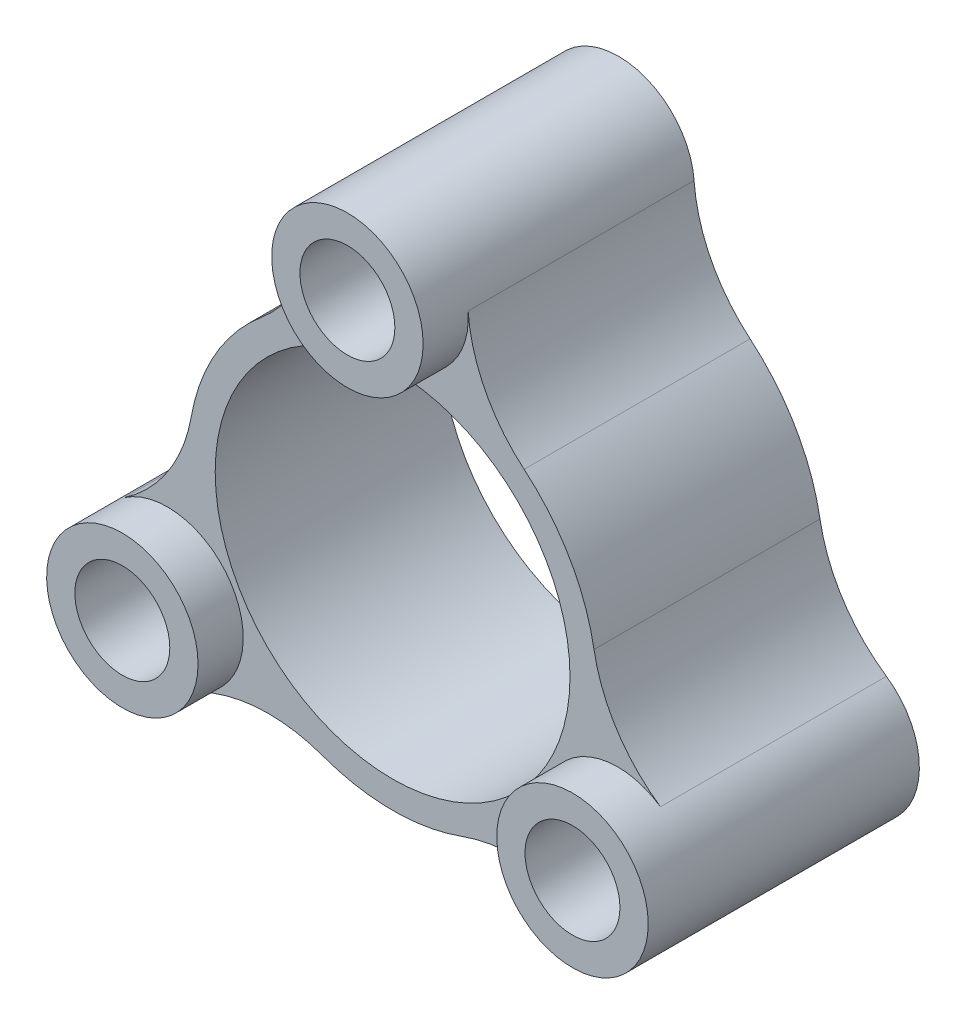
ISO-10303-21;
HEADER;
FILE_DESCRIPTION(('STEP AP214'),'2;1');
FILE_NAME('part.step','',(''),(''),'','','');
FILE_SCHEMA(('AUTOMOTIVE_DESIGN { 1 0 10303 214 1 1 1 1 }'));
ENDSEC;
DATA;
#1=APPLICATION_CONTEXT('core data for automotive mechanical design processes');
#2=APPLICATION_PROTOCOL_DEFINITION('international standard','automotive_design',2000,#1);
#3=PRODUCT_CONTEXT('',#1,'mechanical');
#4=PRODUCT('Part','Part','',(#3));
#5=PRODUCT_RELATED_PRODUCT_CATEGORY('part','',(#4));
#6=PRODUCT_DEFINITION_FORMATION('','',#4);
#7=PRODUCT_DEFINITION_CONTEXT('part definition',#1,'design');
#8=PRODUCT_DEFINITION('design','',#6,#7);
#9=PRODUCT_DEFINITION_SHAPE('','',#8);
#10=(LENGTH_UNIT() NAMED_UNIT(*) SI_UNIT(.MILLI.,.METRE.));
#11=(NAMED_UNIT(*) PLANE_ANGLE_UNIT() SI_UNIT($,.RADIAN.));
#12=(NAMED_UNIT(*) SI_UNIT($,.STERADIAN.) SOLID_ANGLE_UNIT());
#13=UNCERTAINTY_MEASURE_WITH_UNIT(LENGTH_MEASURE(1.E-05),#10,'distance_accuracy_value','');
#14=(GEOMETRIC_REPRESENTATION_CONTEXT(3) GLOBAL_UNCERTAINTY_ASSIGNED_CONTEXT((#13)) GLOBAL_UNIT_ASSIGNED_CONTEXT((#10,
#11,#12)) REPRESENTATION_CONTEXT('',''));
#15=CARTESIAN_POINT('',(0.,0.,0.));
#16=DIRECTION('',(0.,0.,1.));
#17=DIRECTION('',(1.,0.,0.));
#18=AXIS2_PLACEMENT_3D('',#15,#16,#17);
#19=CARTESIAN_POINT('',(7.72260023445402,-10.4166727230345,10.));
#20=DIRECTION('',(0.,0.,-1.));
#21=DIRECTION('',(-1.,0.,0.));
#22=AXIS2_PLACEMENT_3D('',#19,#20,#21);
#23=PLANE('',#22);
#24=CARTESIAN_POINT('',(0.,0.,10.));
#25=DIRECTION('',(0.,0.,1.));
#26=DIRECTION('',(1.,0.,0.));
#27=AXIS2_PLACEMENT_3D('',#24,#25,#26);
#28=CIRCLE('',#27,7.85);
#29=CARTESIAN_POINT('',(7.85,0.,10.));
#30=VERTEX_POINT('',#29);
#31=EDGE_CURVE('E159',#30,#30,#28,.T.);
#32=ORIENTED_EDGE('',*,*,#31,.F.);
#33=EDGE_LOOP('',(#32));
#34=FACE_BOUND('',#33,.T.);
#35=CARTESIAN_POINT('',(-9.95929214352104,-5.75,10.));
#36=DIRECTION('',(0.,0.,1.));
#37=DIRECTION('',(1.,0.,0.));
#38=AXIS2_PLACEMENT_3D('',#35,#36,#37);
#39=CIRCLE('',#38,3.35);
#40=CARTESIAN_POINT('',(-8.51138530383514,-8.770937898003,10.));
#41=VERTEX_POINT('',#40);
#42=CARTESIAN_POINT('',(-11.8515476866039,-2.98560694551727,10.));
#43=VERTEX_POINT('',#42);
#44=EDGE_CURVE('E11',#41,#43,#39,.T.);
#45=ORIENTED_EDGE('',*,*,#44,.F.);
#46=CARTESIAN_POINT('',(-5.48590832538699,-15.083345446069,10.));
#47=DIRECTION('',(0.,0.,-1.));
#48=DIRECTION('',(1.,0.,0.));
#49=AXIS2_PLACEMENT_3D('',#46,#47,#48);
#50=CIRCLE('',#49,7.);
#51=CARTESIAN_POINT('',(-3.09330033300637,-8.50493933251864,10.));
#52=VERTEX_POINT('',#51);
#53=EDGE_CURVE('E134',#41,#52,#50,.T.);
#54=ORIENTED_EDGE('',*,*,#53,.T.);
#55=CARTESIAN_POINT('',(0.,0.,10.));
#56=DIRECTION('',(0.,0.,1.));
#57=DIRECTION('',(1.,0.,0.));
#58=AXIS2_PLACEMENT_3D('',#55,#56,#57);
#59=CIRCLE('',#58,9.05);
#60=CARTESIAN_POINT('',(3.09330033300637,-8.50493933251864,10.));
#61=VERTEX_POINT('',#60);
#62=EDGE_CURVE('E58',#52,#61,#59,.T.);
#63=ORIENTED_EDGE('',*,*,#62,.T.);
#64=CARTESIAN_POINT('',(5.48590832538699,-15.083345446069,10.));
#65=DIRECTION('',(0.,0.,-1.));
#66=DIRECTION('',(-1.,0.,0.));
#67=AXIS2_PLACEMENT_3D('',#64,#65,#66);
#68=CIRCLE('',#67,7.);
#69=CARTESIAN_POINT('',(8.51138530383514,-8.770937898003,10.));
#70=VERTEX_POINT('',#69);
#71=EDGE_CURVE('E112',#61,#70,#68,.T.);
#72=ORIENTED_EDGE('',*,*,#71,.T.);
#73=CARTESIAN_POINT('',(9.95929214352105,-5.75,10.));
#74=DIRECTION('',(0.,0.,1.));
#75=DIRECTION('',(1.,0.,0.));
#76=AXIS2_PLACEMENT_3D('',#73,#74,#75);
#77=CIRCLE('',#76,3.35);
#78=CARTESIAN_POINT('',(11.8515476866039,-2.98560694551726,10.));
#79=VERTEX_POINT('',#78);
#80=EDGE_CURVE('E222',#79,#70,#77,.T.);
#81=ORIENTED_EDGE('',*,*,#80,.F.);
#82=CARTESIAN_POINT('',(15.8055144930455,2.7907367504168,10.));
#83=DIRECTION('',(0.,0.,-1.));
#84=DIRECTION('',(1.,0.,0.));
#85=AXIS2_PLACEMENT_3D('',#82,#83,#84);
#86=CIRCLE('',#85,7.);
#87=CARTESIAN_POINT('',(8.9121436861098,1.57359299634094,10.));
#88=VERTEX_POINT('',#87);
#89=EDGE_CURVE('E245',#79,#88,#86,.T.);
#90=ORIENTED_EDGE('',*,*,#89,.T.);
#91=CARTESIAN_POINT('',(0.,0.,10.));
#92=DIRECTION('',(0.,0.,1.));
#93=DIRECTION('',(1.,0.,0.));
#94=AXIS2_PLACEMENT_3D('',#91,#92,#93);
#95=CIRCLE('',#94,9.05);
#96=CARTESIAN_POINT('',(5.81884335310343,6.9313463361777,10.));
#97=VERTEX_POINT('',#96);
#98=EDGE_CURVE('E247',#88,#97,#95,.T.);
#99=ORIENTED_EDGE('',*,*,#98,.T.);
#100=CARTESIAN_POINT('',(10.3196061676586,12.2926086956522,10.));
#101=DIRECTION('',(0.,0.,-1.));
#102=DIRECTION('',(-1.,0.,0.));
#103=AXIS2_PLACEMENT_3D('',#100,#101,#102);
#104=CIRCLE('',#103,7.);
#105=CARTESIAN_POINT('',(3.34016238276871,11.7565448435203,10.));
#106=VERTEX_POINT('',#105);
#107=EDGE_CURVE('E249',#97,#106,#104,.T.);
#108=ORIENTED_EDGE('',*,*,#107,.T.);
#109=CARTESIAN_POINT('',(0.,11.5,10.));
#110=DIRECTION('',(0.,0.,1.));
#111=DIRECTION('',(1.,0.,0.));
#112=AXIS2_PLACEMENT_3D('',#109,#110,#111);
#113=CIRCLE('',#112,3.35);
#114=CARTESIAN_POINT('',(-3.34016238276871,11.7565448435203,10.));
#115=VERTEX_POINT('',#114);
#116=EDGE_CURVE('E49',#115,#106,#113,.T.);
#117=ORIENTED_EDGE('',*,*,#116,.F.);
#118=CARTESIAN_POINT('',(-10.3196061676586,12.2926086956522,10.));
#119=DIRECTION('',(0.,0.,-1.));
#120=DIRECTION('',(1.,0.,0.));
#121=AXIS2_PLACEMENT_3D('',#118,#119,#120);
#122=CIRCLE('',#121,7.);
#123=CARTESIAN_POINT('',(-5.81884335310342,6.9313463361777,10.));
#124=VERTEX_POINT('',#123);
#125=EDGE_CURVE('E252',#115,#124,#122,.T.);
#126=ORIENTED_EDGE('',*,*,#125,.T.);
#127=CARTESIAN_POINT('',(0.,0.,10.));
#128=DIRECTION('',(0.,0.,1.));
#129=DIRECTION('',(1.,0.,0.));
#130=AXIS2_PLACEMENT_3D('',#127,#128,#129);
#131=CIRCLE('',#130,9.05);
#132=CARTESIAN_POINT('',(-8.9121436861098,1.57359299634094,10.));
#133=VERTEX_POINT('',#132);
#134=EDGE_CURVE('E151',#124,#133,#131,.T.);
#135=ORIENTED_EDGE('',*,*,#134,.T.);
#136=CARTESIAN_POINT('',(-15.8055144930455,2.7907367504168,10.));
#137=DIRECTION('',(0.,0.,-1.));
#138=DIRECTION('',(-1.,0.,0.));
#139=AXIS2_PLACEMENT_3D('',#136,#137,#138);
#140=CIRCLE('',#139,7.);
#141=EDGE_CURVE('E136',#133,#43,#140,.T.);
#142=ORIENTED_EDGE('',*,*,#141,.T.);
#143=EDGE_LOOP('',(#45,#54,#63,#72,#81,#90,#99,#108,#117,#126,#135,#142));
#144=FACE_BOUND('',#143,.T.);
#145=ADVANCED_FACE('F39',(#34,#144),#23,.F.);
#146=CARTESIAN_POINT('',(7.72260023445402,-10.4166727230345,0.));
#147=DIRECTION('',(0.,0.,-1.));
#148=DIRECTION('',(-1.,0.,0.));
#149=AXIS2_PLACEMENT_3D('',#146,#147,#148);
#150=PLANE('',#149);
#151=CARTESIAN_POINT('',(0.,11.5,0.));
#152=DIRECTION('',(0.,0.,1.));
#153=DIRECTION('',(1.,0.,0.));
#154=AXIS2_PLACEMENT_3D('',#151,#152,#153);
#155=CIRCLE('',#154,2.1);
#156=CARTESIAN_POINT('',(2.1,11.5,0.));
#157=VERTEX_POINT('',#156);
#158=EDGE_CURVE('E232',#157,#157,#155,.T.);
#159=ORIENTED_EDGE('',*,*,#158,.T.);
#160=EDGE_LOOP('',(#159));
#161=FACE_BOUND('',#160,.T.);
#162=CARTESIAN_POINT('',(0.,0.,0.));
#163=DIRECTION('',(0.,0.,1.));
#164=DIRECTION('',(1.,0.,0.));
#165=AXIS2_PLACEMENT_3D('',#162,#163,#164);
#166=CIRCLE('',#165,7.85);
#167=CARTESIAN_POINT('',(7.85,0.,0.));
#168=VERTEX_POINT('',#167);
#169=EDGE_CURVE('E239',#168,#168,#166,.T.);
#170=ORIENTED_EDGE('',*,*,#169,.T.);
#171=EDGE_LOOP('',(#170));
#172=FACE_BOUND('',#171,.T.);
#173=CARTESIAN_POINT('',(5.48590832538699,-15.083345446069,0.));
#174=DIRECTION('',(0.,0.,-1.));
#175=DIRECTION('',(-1.,0.,0.));
#176=AXIS2_PLACEMENT_3D('',#173,#174,#175);
#177=CIRCLE('',#176,7.);
#178=CARTESIAN_POINT('',(3.09330033300637,-8.50493933251864,0.));
#179=VERTEX_POINT('',#178);
#180=CARTESIAN_POINT('',(8.51138530383514,-8.770937898003,0.));
#181=VERTEX_POINT('',#180);
#182=EDGE_CURVE('E155',#179,#181,#177,.T.);
#183=ORIENTED_EDGE('',*,*,#182,.F.);
#184=CARTESIAN_POINT('',(0.,0.,0.));
#185=DIRECTION('',(0.,0.,1.));
#186=DIRECTION('',(1.,0.,0.));
#187=AXIS2_PLACEMENT_3D('',#184,#185,#186);
#188=CIRCLE('',#187,9.05);
#189=CARTESIAN_POINT('',(-3.09330033300637,-8.50493933251864,0.));
#190=VERTEX_POINT('',#189);
#191=EDGE_CURVE('E106',#190,#179,#188,.T.);
#192=ORIENTED_EDGE('',*,*,#191,.F.);
#193=CARTESIAN_POINT('',(-5.48590832538699,-15.083345446069,0.));
#194=DIRECTION('',(0.,0.,-1.));
#195=DIRECTION('',(1.,0.,0.));
#196=AXIS2_PLACEMENT_3D('',#193,#194,#195);
#197=CIRCLE('',#196,7.);
#198=CARTESIAN_POINT('',(-8.51138530383514,-8.770937898003,0.));
#199=VERTEX_POINT('',#198);
#200=EDGE_CURVE('E100',#199,#190,#197,.T.);
#201=ORIENTED_EDGE('',*,*,#200,.F.);
#202=CARTESIAN_POINT('',(-9.95929214352104,-5.75,0.));
#203=DIRECTION('',(0.,0.,1.));
#204=DIRECTION('',(1.,0.,0.));
#205=AXIS2_PLACEMENT_3D('',#202,#203,#204);
#206=CIRCLE('',#205,3.35);
#207=CARTESIAN_POINT('',(-11.8515476866039,-2.98560694551727,0.));
#208=VERTEX_POINT('',#207);
#209=EDGE_CURVE('E143',#208,#199,#206,.T.);
#210=ORIENTED_EDGE('',*,*,#209,.F.);
#211=CARTESIAN_POINT('',(-15.8055144930455,2.7907367504168,0.));
#212=DIRECTION('',(0.,0.,-1.));
#213=DIRECTION('',(-1.,0.,0.));
#214=AXIS2_PLACEMENT_3D('',#211,#212,#213);
#215=CIRCLE('',#214,7.);
#216=CARTESIAN_POINT('',(-8.9121436861098,1.57359299634094,0.));
#217=VERTEX_POINT('',#216);
#218=EDGE_CURVE('E173',#217,#208,#215,.T.);
#219=ORIENTED_EDGE('',*,*,#218,.F.);
#220=CARTESIAN_POINT('',(0.,0.,0.));
#221=DIRECTION('',(0.,0.,1.));
#222=DIRECTION('',(1.,0.,0.));
#223=AXIS2_PLACEMENT_3D('',#220,#221,#222);
#224=CIRCLE('',#223,9.05);
#225=CARTESIAN_POINT('',(-5.81884335310342,6.9313463361777,0.));
#226=VERTEX_POINT('',#225);
#227=EDGE_CURVE('E171',#226,#217,#224,.T.);
#228=ORIENTED_EDGE('',*,*,#227,.F.);
#229=CARTESIAN_POINT('',(-10.3196061676586,12.2926086956522,0.));
#230=DIRECTION('',(0.,0.,-1.));
#231=DIRECTION('',(1.,0.,0.));
#232=AXIS2_PLACEMENT_3D('',#229,#230,#231);
#233=CIRCLE('',#232,7.);
#234=CARTESIAN_POINT('',(-3.34016238276871,11.7565448435203,0.));
#235=VERTEX_POINT('',#234);
#236=EDGE_CURVE('E169',#235,#226,#233,.T.);
#237=ORIENTED_EDGE('',*,*,#236,.F.);
#238=CARTESIAN_POINT('',(0.,11.5,0.));
#239=DIRECTION('',(0.,0.,1.));
#240=DIRECTION('',(1.,0.,0.));
#241=AXIS2_PLACEMENT_3D('',#238,#239,#240);
#242=CIRCLE('',#241,3.35);
#243=CARTESIAN_POINT('',(3.34016238276871,11.7565448435203,0.));
#244=VERTEX_POINT('',#243);
#245=EDGE_CURVE('E167',#244,#235,#242,.T.);
#246=ORIENTED_EDGE('',*,*,#245,.F.);
#247=CARTESIAN_POINT('',(10.3196061676586,12.2926086956522,0.));
#248=DIRECTION('',(0.,0.,-1.));
#249=DIRECTION('',(-1.,0.,0.));
#250=AXIS2_PLACEMENT_3D('',#247,#248,#249);
#251=CIRCLE('',#250,7.);
#252=CARTESIAN_POINT('',(5.81884335310343,6.9313463361777,0.));
#253=VERTEX_POINT('',#252);
#254=EDGE_CURVE('E165',#253,#244,#251,.T.);
#255=ORIENTED_EDGE('',*,*,#254,.F.);
#256=CARTESIAN_POINT('',(0.,0.,0.));
#257=DIRECTION('',(0.,0.,1.));
#258=DIRECTION('',(1.,0.,0.));
#259=AXIS2_PLACEMENT_3D('',#256,#257,#258);
#260=CIRCLE('',#259,9.05);
#261=CARTESIAN_POINT('',(8.9121436861098,1.57359299634094,0.));
#262=VERTEX_POINT('',#261);
#263=EDGE_CURVE('E163',#262,#253,#260,.T.);
#264=ORIENTED_EDGE('',*,*,#263,.F.);
#265=CARTESIAN_POINT('',(15.8055144930455,2.7907367504168,0.));
#266=DIRECTION('',(0.,0.,-1.));
#267=DIRECTION('',(1.,0.,0.));
#268=AXIS2_PLACEMENT_3D('',#265,#266,#267);
#269=CIRCLE('',#268,7.);
#270=CARTESIAN_POINT('',(11.8515476866039,-2.98560694551726,0.));
#271=VERTEX_POINT('',#270);
#272=EDGE_CURVE('E161',#271,#262,#269,.T.);
#273=ORIENTED_EDGE('',*,*,#272,.F.);
#274=CARTESIAN_POINT('',(9.95929214352104,-5.75,0.));
#275=DIRECTION('',(0.,0.,1.));
#276=DIRECTION('',(1.,0.,0.));
#277=AXIS2_PLACEMENT_3D('',#274,#275,#276);
#278=CIRCLE('',#277,3.35);
#279=EDGE_CURVE('E158',#181,#271,#278,.T.);
#280=ORIENTED_EDGE('',*,*,#279,.F.);
#281=EDGE_LOOP('',(#183,#192,#201,#210,#219,#228,#237,#246,#255,#264,#273,#280));
#282=FACE_BOUND('',#281,.T.);
#283=CARTESIAN_POINT('',(9.95929214352104,-5.75,0.));
#284=DIRECTION('',(0.,0.,1.));
#285=DIRECTION('',(1.,0.,0.));
#286=AXIS2_PLACEMENT_3D('',#283,#284,#285);
#287=CIRCLE('',#286,2.1);
#288=CARTESIAN_POINT('',(12.059292143521,-5.75,0.));
#289=VERTEX_POINT('',#288);
#290=EDGE_CURVE('E236',#289,#289,#287,.T.);
#291=ORIENTED_EDGE('',*,*,#290,.T.);
#292=EDGE_LOOP('',(#291));
#293=FACE_BOUND('',#292,.T.);
#294=CARTESIAN_POINT('',(-9.95929214352104,-5.75,0.));
#295=DIRECTION('',(0.,0.,1.));
#296=DIRECTION('',(1.,0.,0.));
#297=AXIS2_PLACEMENT_3D('',#294,#295,#296);
#298=CIRCLE('',#297,2.1);
#299=CARTESIAN_POINT('',(-7.85929214352104,-5.75,0.));
#300=VERTEX_POINT('',#299);
#301=EDGE_CURVE('E229',#300,#300,#298,.T.);
#302=ORIENTED_EDGE('',*,*,#301,.T.);
#303=EDGE_LOOP('',(#302));
#304=FACE_BOUND('',#303,.T.);
#305=ADVANCED_FACE('F266',(#161,#172,#282,#293,#304),#150,.T.);
#306=CARTESIAN_POINT('',(5.48590832538699,-15.083345446069,10.));
#307=DIRECTION('',(0.,0.,-1.));
#308=DIRECTION('',(-1.,0.,0.));
#309=AXIS2_PLACEMENT_3D('',#306,#307,#308);
#310=CYLINDRICAL_SURFACE('',#309,7.);
#311=ORIENTED_EDGE('',*,*,#182,.T.);
#312=DIRECTION('',(0.,0.,-1.));
#313=VECTOR('',#312,1.);
#314=CARTESIAN_POINT('',(8.51138530383514,-8.770937898003,10.));
#315=LINE('',#314,#313);
#316=EDGE_CURVE('E43',#70,#181,#315,.T.);
#317=ORIENTED_EDGE('',*,*,#316,.F.);
#318=ORIENTED_EDGE('',*,*,#71,.F.);
#319=DIRECTION('',(0.,0.,-1.));
#320=VECTOR('',#319,1.);
#321=CARTESIAN_POINT('',(3.09330033300637,-8.50493933251864,10.));
#322=LINE('',#321,#320);
#323=EDGE_CURVE('E149',#61,#179,#322,.T.);
#324=ORIENTED_EDGE('',*,*,#323,.T.);
#325=EDGE_LOOP('',(#311,#317,#318,#324));
#326=FACE_BOUND('',#325,.T.);
#327=ADVANCED_FACE('F41',(#326),#310,.F.);
#328=CARTESIAN_POINT('',(9.95929214352104,-5.75,10.));
#329=DIRECTION('',(0.,0.,-1.));
#330=DIRECTION('',(-1.,0.,0.));
#331=AXIS2_PLACEMENT_3D('',#328,#329,#330);
#332=CYLINDRICAL_SURFACE('',#331,3.35);
#333=ORIENTED_EDGE('',*,*,#279,.T.);
#334=DIRECTION('',(0.,0.,-1.));
#335=VECTOR('',#334,1.);
#336=CARTESIAN_POINT('',(11.8515476866039,-2.98560694551726,10.));
#337=LINE('',#336,#335);
#338=EDGE_CURVE('E198',#79,#271,#337,.T.);
#339=ORIENTED_EDGE('',*,*,#338,.F.);
#340=ORIENTED_EDGE('',*,*,#80,.T.);
#341=ORIENTED_EDGE('',*,*,#316,.T.);
#342=EDGE_LOOP('',(#333,#339,#340,#341));
#343=FACE_BOUND('',#342,.T.);
#344=CARTESIAN_POINT('',(9.95929214352105,-5.75,12.));
#345=DIRECTION('',(0.,0.,1.));
#346=DIRECTION('',(1.,0.,0.));
#347=AXIS2_PLACEMENT_3D('',#344,#345,#346);
#348=CIRCLE('',#347,3.35);
#349=CARTESIAN_POINT('',(13.309292143521,-5.75,12.));
#350=VERTEX_POINT('',#349);
#351=EDGE_CURVE('E224',#350,#350,#348,.T.);
#352=ORIENTED_EDGE('',*,*,#351,.F.);
#353=EDGE_LOOP('',(#352));
#354=FACE_BOUND('',#353,.T.);
#355=ADVANCED_FACE('F349',(#343,#354),#332,.T.);
#356=CARTESIAN_POINT('',(15.8055144930455,2.7907367504168,10.));
#357=DIRECTION('',(0.,0.,-1.));
#358=DIRECTION('',(-1.,0.,0.));
#359=AXIS2_PLACEMENT_3D('',#356,#357,#358);
#360=CYLINDRICAL_SURFACE('',#359,7.);
#361=ORIENTED_EDGE('',*,*,#272,.T.);
#362=DIRECTION('',(0.,0.,-1.));
#363=VECTOR('',#362,1.);
#364=CARTESIAN_POINT('',(8.9121436861098,1.57359299634094,10.));
#365=LINE('',#364,#363);
#366=EDGE_CURVE('E196',#88,#262,#365,.T.);
#367=ORIENTED_EDGE('',*,*,#366,.F.);
#368=ORIENTED_EDGE('',*,*,#89,.F.);
#369=ORIENTED_EDGE('',*,*,#338,.T.);
#370=EDGE_LOOP('',(#361,#367,#368,#369));
#371=FACE_BOUND('',#370,.T.);
#372=ADVANCED_FACE('F346',(#371),#360,.F.);
#373=CARTESIAN_POINT('',(0.,0.,10.));
#374=DIRECTION('',(0.,0.,-1.));
#375=DIRECTION('',(-1.,0.,0.));
#376=AXIS2_PLACEMENT_3D('',#373,#374,#375);
#377=CYLINDRICAL_SURFACE('',#376,9.05);
#378=ORIENTED_EDGE('',*,*,#263,.T.);
#379=DIRECTION('',(0.,0.,-1.));
#380=VECTOR('',#379,1.);
#381=CARTESIAN_POINT('',(5.81884335310343,6.9313463361777,10.));
#382=LINE('',#381,#380);
#383=EDGE_CURVE('E193',#97,#253,#382,.T.);
#384=ORIENTED_EDGE('',*,*,#383,.F.);
#385=ORIENTED_EDGE('',*,*,#98,.F.);
#386=ORIENTED_EDGE('',*,*,#366,.T.);
#387=EDGE_LOOP('',(#378,#384,#385,#386));
#388=FACE_BOUND('',#387,.T.);
#389=ADVANCED_FACE('F342',(#388),#377,.T.);
#390=CARTESIAN_POINT('',(10.3196061676586,12.2926086956522,10.));
#391=DIRECTION('',(0.,0.,-1.));
#392=DIRECTION('',(-1.,0.,0.));
#393=AXIS2_PLACEMENT_3D('',#390,#391,#392);
#394=CYLINDRICAL_SURFACE('',#393,7.);
#395=ORIENTED_EDGE('',*,*,#254,.T.);
#396=DIRECTION('',(0.,0.,-1.));
#397=VECTOR('',#396,1.);
#398=CARTESIAN_POINT('',(3.34016238276871,11.7565448435203,10.));
#399=LINE('',#398,#397);
#400=EDGE_CURVE('E190',#106,#244,#399,.T.);
#401=ORIENTED_EDGE('',*,*,#400,.F.);
#402=ORIENTED_EDGE('',*,*,#107,.F.);
#403=ORIENTED_EDGE('',*,*,#383,.T.);
#404=EDGE_LOOP('',(#395,#401,#402,#403));
#405=FACE_BOUND('',#404,.T.);
#406=ADVANCED_FACE('F339',(#405),#394,.F.);
#407=CARTESIAN_POINT('',(0.,11.5,10.));
#408=DIRECTION('',(0.,0.,-1.));
#409=DIRECTION('',(-1.,0.,0.));
#410=AXIS2_PLACEMENT_3D('',#407,#408,#409);
#411=CYLINDRICAL_SURFACE('',#410,3.35);
#412=ORIENTED_EDGE('',*,*,#245,.T.);
#413=DIRECTION('',(0.,0.,-1.));
#414=VECTOR('',#413,1.);
#415=CARTESIAN_POINT('',(-3.34016238276871,11.7565448435203,10.));
#416=LINE('',#415,#414);
#417=EDGE_CURVE('E187',#115,#235,#416,.T.);
#418=ORIENTED_EDGE('',*,*,#417,.F.);
#419=ORIENTED_EDGE('',*,*,#116,.T.);
#420=ORIENTED_EDGE('',*,*,#400,.T.);
#421=EDGE_LOOP('',(#412,#418,#419,#420));
#422=FACE_BOUND('',#421,.T.);
#423=CARTESIAN_POINT('',(0.,11.5,12.));
#424=DIRECTION('',(0.,0.,1.));
#425=DIRECTION('',(1.,0.,0.));
#426=AXIS2_PLACEMENT_3D('',#423,#424,#425);
#427=CIRCLE('',#426,3.35);
#428=CARTESIAN_POINT('',(3.35,11.5,12.));
#429=VERTEX_POINT('',#428);
#430=EDGE_CURVE('E214',#429,#429,#427,.T.);
#431=ORIENTED_EDGE('',*,*,#430,.F.);
#432=EDGE_LOOP('',(#431));
#433=FACE_BOUND('',#432,.T.);
#434=ADVANCED_FACE('F335',(#422,#433),#411,.T.);
#435=CARTESIAN_POINT('',(-10.3196061676586,12.2926086956522,10.));
#436=DIRECTION('',(0.,0.,-1.));
#437=DIRECTION('',(-1.,0.,0.));
#438=AXIS2_PLACEMENT_3D('',#435,#436,#437);
#439=CYLINDRICAL_SURFACE('',#438,7.);
#440=ORIENTED_EDGE('',*,*,#236,.T.);
#441=DIRECTION('',(0.,0.,-1.));
#442=VECTOR('',#441,1.);
#443=CARTESIAN_POINT('',(-5.81884335310342,6.9313463361777,10.));
#444=LINE('',#443,#442);
#445=EDGE_CURVE('E184',#124,#226,#444,.T.);
#446=ORIENTED_EDGE('',*,*,#445,.F.);
#447=ORIENTED_EDGE('',*,*,#125,.F.);
#448=ORIENTED_EDGE('',*,*,#417,.T.);
#449=EDGE_LOOP('',(#440,#446,#447,#448));
#450=FACE_BOUND('',#449,.T.);
#451=ADVANCED_FACE('F333',(#450),#439,.F.);
#452=CARTESIAN_POINT('',(0.,0.,10.));
#453=DIRECTION('',(0.,0.,-1.));
#454=DIRECTION('',(-1.,0.,0.));
#455=AXIS2_PLACEMENT_3D('',#452,#453,#454);
#456=CYLINDRICAL_SURFACE('',#455,9.05);
#457=ORIENTED_EDGE('',*,*,#227,.T.);
#458=DIRECTION('',(0.,0.,-1.));
#459=VECTOR('',#458,1.);
#460=CARTESIAN_POINT('',(-8.9121436861098,1.57359299634094,10.));
#461=LINE('',#460,#459);
#462=EDGE_CURVE('E181',#133,#217,#461,.T.);
#463=ORIENTED_EDGE('',*,*,#462,.F.);
#464=ORIENTED_EDGE('',*,*,#134,.F.);
#465=ORIENTED_EDGE('',*,*,#445,.T.);
#466=EDGE_LOOP('',(#457,#463,#464,#465));
#467=FACE_BOUND('',#466,.T.);
#468=ADVANCED_FACE('F258',(#467),#456,.T.);
#469=CARTESIAN_POINT('',(-15.8055144930455,2.7907367504168,10.));
#470=DIRECTION('',(0.,0.,-1.));
#471=DIRECTION('',(-1.,0.,0.));
#472=AXIS2_PLACEMENT_3D('',#469,#470,#471);
#473=CYLINDRICAL_SURFACE('',#472,7.);
#474=ORIENTED_EDGE('',*,*,#218,.T.);
#475=DIRECTION('',(0.,0.,-1.));
#476=VECTOR('',#475,1.);
#477=CARTESIAN_POINT('',(-11.8515476866039,-2.98560694551727,10.));
#478=LINE('',#477,#476);
#479=EDGE_CURVE('E144',#43,#208,#478,.T.);
#480=ORIENTED_EDGE('',*,*,#479,.F.);
#481=ORIENTED_EDGE('',*,*,#141,.F.);
#482=ORIENTED_EDGE('',*,*,#462,.T.);
#483=EDGE_LOOP('',(#474,#480,#481,#482));
#484=FACE_BOUND('',#483,.T.);
#485=ADVANCED_FACE('F263',(#484),#473,.F.);
#486=CARTESIAN_POINT('',(-9.95929214352104,-5.75,10.));
#487=DIRECTION('',(0.,0.,-1.));
#488=DIRECTION('',(-1.,0.,0.));
#489=AXIS2_PLACEMENT_3D('',#486,#487,#488);
#490=CYLINDRICAL_SURFACE('',#489,3.35);
#491=ORIENTED_EDGE('',*,*,#209,.T.);
#492=DIRECTION('',(0.,0.,-1.));
#493=VECTOR('',#492,1.);
#494=CARTESIAN_POINT('',(-8.51138530383514,-8.770937898003,10.));
#495=LINE('',#494,#493);
#496=EDGE_CURVE('E139',#41,#199,#495,.T.);
#497=ORIENTED_EDGE('',*,*,#496,.F.);
#498=ORIENTED_EDGE('',*,*,#44,.T.);
#499=ORIENTED_EDGE('',*,*,#479,.T.);
#500=EDGE_LOOP('',(#491,#497,#498,#499));
#501=FACE_BOUND('',#500,.T.);
#502=CARTESIAN_POINT('',(-9.95929214352104,-5.75,12.));
#503=DIRECTION('',(0.,0.,1.));
#504=DIRECTION('',(1.,0.,0.));
#505=AXIS2_PLACEMENT_3D('',#502,#503,#504);
#506=CIRCLE('',#505,3.35);
#507=CARTESIAN_POINT('',(-6.60929214352104,-5.75,12.));
#508=VERTEX_POINT('',#507);
#509=EDGE_CURVE('E233',#508,#508,#506,.T.);
#510=ORIENTED_EDGE('',*,*,#509,.F.);
#511=EDGE_LOOP('',(#510));
#512=FACE_BOUND('',#511,.T.);
#513=ADVANCED_FACE('F140',(#501,#512),#490,.T.);
#514=CARTESIAN_POINT('',(-5.48590832538699,-15.083345446069,10.));
#515=DIRECTION('',(0.,0.,-1.));
#516=DIRECTION('',(-1.,0.,0.));
#517=AXIS2_PLACEMENT_3D('',#514,#515,#516);
#518=CYLINDRICAL_SURFACE('',#517,7.);
#519=ORIENTED_EDGE('',*,*,#200,.T.);
#520=DIRECTION('',(0.,0.,-1.));
#521=VECTOR('',#520,1.);
#522=CARTESIAN_POINT('',(-3.09330033300637,-8.50493933251864,10.));
#523=LINE('',#522,#521);
#524=EDGE_CURVE('E145',#52,#190,#523,.T.);
#525=ORIENTED_EDGE('',*,*,#524,.F.);
#526=ORIENTED_EDGE('',*,*,#53,.F.);
#527=ORIENTED_EDGE('',*,*,#496,.T.);
#528=EDGE_LOOP('',(#519,#525,#526,#527));
#529=FACE_BOUND('',#528,.T.);
#530=ADVANCED_FACE('F147',(#529),#518,.F.);
#531=CARTESIAN_POINT('',(0.,0.,10.));
#532=DIRECTION('',(0.,0.,-1.));
#533=DIRECTION('',(-1.,0.,0.));
#534=AXIS2_PLACEMENT_3D('',#531,#532,#533);
#535=CYLINDRICAL_SURFACE('',#534,9.05);
#536=ORIENTED_EDGE('',*,*,#191,.T.);
#537=ORIENTED_EDGE('',*,*,#323,.F.);
#538=ORIENTED_EDGE('',*,*,#62,.F.);
#539=ORIENTED_EDGE('',*,*,#524,.T.);
#540=EDGE_LOOP('',(#536,#537,#538,#539));
#541=FACE_BOUND('',#540,.T.);
#542=ADVANCED_FACE('F269',(#541),#535,.T.);
#543=CARTESIAN_POINT('',(0.,0.,10.));
#544=DIRECTION('',(0.,0.,-1.));
#545=DIRECTION('',(-1.,0.,0.));
#546=AXIS2_PLACEMENT_3D('',#543,#544,#545);
#547=CYLINDRICAL_SURFACE('',#546,7.85);
#548=ORIENTED_EDGE('',*,*,#31,.T.);
#549=EDGE_LOOP('',(#548));
#550=FACE_BOUND('',#549,.T.);
#551=ORIENTED_EDGE('',*,*,#169,.F.);
#552=EDGE_LOOP('',(#551));
#553=FACE_BOUND('',#552,.T.);
#554=ADVANCED_FACE('F271',(#550,#553),#547,.F.);
#555=CARTESIAN_POINT('',(9.95929214352104,-5.75,10.));
#556=DIRECTION('',(0.,0.,-1.));
#557=DIRECTION('',(-1.,0.,0.));
#558=AXIS2_PLACEMENT_3D('',#555,#556,#557);
#559=CYLINDRICAL_SURFACE('',#558,2.1);
#560=ORIENTED_EDGE('',*,*,#290,.F.);
#561=EDGE_LOOP('',(#560));
#562=FACE_BOUND('',#561,.T.);
#563=CARTESIAN_POINT('',(9.95929214352105,-5.75,12.));
#564=DIRECTION('',(0.,0.,1.));
#565=DIRECTION('',(1.,0.,0.));
#566=AXIS2_PLACEMENT_3D('',#563,#564,#565);
#567=CIRCLE('',#566,2.1);
#568=CARTESIAN_POINT('',(12.059292143521,-5.75,12.));
#569=VERTEX_POINT('',#568);
#570=EDGE_CURVE('E218',#569,#569,#567,.T.);
#571=ORIENTED_EDGE('',*,*,#570,.T.);
#572=EDGE_LOOP('',(#571));
#573=FACE_BOUND('',#572,.T.);
#574=ADVANCED_FACE('F277',(#562,#573),#559,.F.);
#575=CARTESIAN_POINT('',(0.,11.5,10.));
#576=DIRECTION('',(0.,0.,-1.));
#577=DIRECTION('',(-1.,0.,0.));
#578=AXIS2_PLACEMENT_3D('',#575,#576,#577);
#579=CYLINDRICAL_SURFACE('',#578,2.1);
#580=ORIENTED_EDGE('',*,*,#158,.F.);
#581=EDGE_LOOP('',(#580));
#582=FACE_BOUND('',#581,.T.);
#583=CARTESIAN_POINT('',(0.,11.5,12.));
#584=DIRECTION('',(0.,0.,1.));
#585=DIRECTION('',(1.,0.,0.));
#586=AXIS2_PLACEMENT_3D('',#583,#584,#585);
#587=CIRCLE('',#586,2.1);
#588=CARTESIAN_POINT('',(2.1,11.5,12.));
#589=VERTEX_POINT('',#588);
#590=EDGE_CURVE('E217',#589,#589,#587,.T.);
#591=ORIENTED_EDGE('',*,*,#590,.T.);
#592=EDGE_LOOP('',(#591));
#593=FACE_BOUND('',#592,.T.);
#594=ADVANCED_FACE('F295',(#582,#593),#579,.F.);
#595=CARTESIAN_POINT('',(-9.95929214352104,-5.75,10.));
#596=DIRECTION('',(0.,0.,-1.));
#597=DIRECTION('',(-1.,0.,0.));
#598=AXIS2_PLACEMENT_3D('',#595,#596,#597);
#599=CYLINDRICAL_SURFACE('',#598,2.1);
#600=ORIENTED_EDGE('',*,*,#301,.F.);
#601=EDGE_LOOP('',(#600));
#602=FACE_BOUND('',#601,.T.);
#603=CARTESIAN_POINT('',(-9.95929214352104,-5.75,12.));
#604=DIRECTION('',(0.,0.,1.));
#605=DIRECTION('',(1.,0.,0.));
#606=AXIS2_PLACEMENT_3D('',#603,#604,#605);
#607=CIRCLE('',#606,2.1);
#608=CARTESIAN_POINT('',(-7.85929214352104,-5.75,12.));
#609=VERTEX_POINT('',#608);
#610=EDGE_CURVE('E221',#609,#609,#607,.T.);
#611=ORIENTED_EDGE('',*,*,#610,.T.);
#612=EDGE_LOOP('',(#611));
#613=FACE_BOUND('',#612,.T.);
#614=ADVANCED_FACE('F299',(#602,#613),#599,.F.);
#615=CARTESIAN_POINT('',(9.95929214352105,-5.75,12.));
#616=DIRECTION('',(0.,0.,1.));
#617=DIRECTION('',(1.,0.,0.));
#618=AXIS2_PLACEMENT_3D('',#615,#616,#617);
#619=PLANE('',#618);
#620=ORIENTED_EDGE('',*,*,#351,.T.);
#621=EDGE_LOOP('',(#620));
#622=FACE_BOUND('',#621,.T.);
#623=ORIENTED_EDGE('',*,*,#570,.F.);
#624=EDGE_LOOP('',(#623));
#625=FACE_BOUND('',#624,.T.);
#626=ADVANCED_FACE('F303',(#622,#625),#619,.T.);
#627=CARTESIAN_POINT('',(0.,11.5,12.));
#628=DIRECTION('',(0.,0.,1.));
#629=DIRECTION('',(1.,0.,0.));
#630=AXIS2_PLACEMENT_3D('',#627,#628,#629);
#631=PLANE('',#630);
#632=ORIENTED_EDGE('',*,*,#430,.T.);
#633=EDGE_LOOP('',(#632));
#634=FACE_BOUND('',#633,.T.);
#635=ORIENTED_EDGE('',*,*,#590,.F.);
#636=EDGE_LOOP('',(#635));
#637=FACE_BOUND('',#636,.T.);
#638=ADVANCED_FACE('F307',(#634,#637),#631,.T.);
#639=CARTESIAN_POINT('',(-9.95929214352104,-5.75,12.));
#640=DIRECTION('',(0.,0.,1.));
#641=DIRECTION('',(1.,0.,0.));
#642=AXIS2_PLACEMENT_3D('',#639,#640,#641);
#643=PLANE('',#642);
#644=ORIENTED_EDGE('',*,*,#509,.T.);
#645=EDGE_LOOP('',(#644));
#646=FACE_BOUND('',#645,.T.);
#647=ORIENTED_EDGE('',*,*,#610,.F.);
#648=EDGE_LOOP('',(#647));
#649=FACE_BOUND('',#648,.T.);
#650=ADVANCED_FACE('F311',(#646,#649),#643,.T.);
#651=CLOSED_SHELL('',(#145,#305,#327,#355,#372,#389,#406,#434,#451,#468,#485,#513,#530,#542,
#554,#574,#594,#614,#626,#638,#650));
#652=MANIFOLD_SOLID_BREP('B2',#651);
#653=ADVANCED_BREP_SHAPE_REPRESENTATION('',(#18,#652),#14);
#654=SHAPE_DEFINITION_REPRESENTATION(#9,#653);
ENDSEC;
END-ISO-10303-21;
